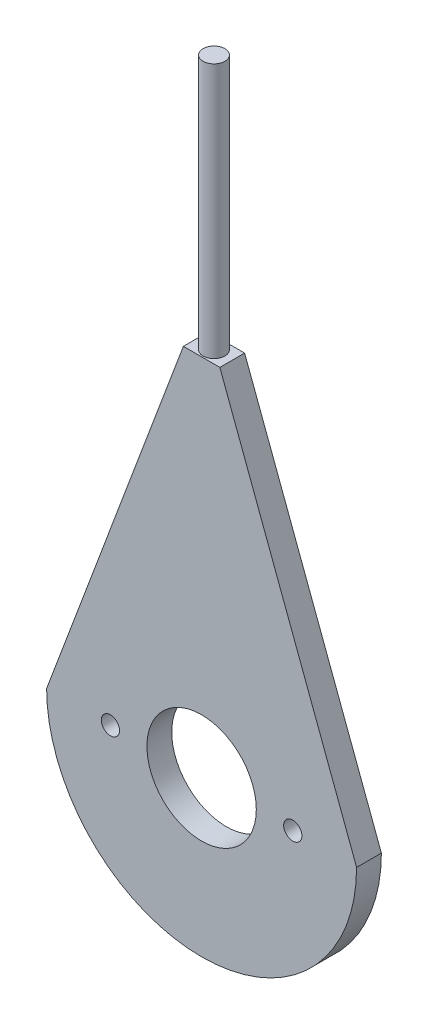
ISO-10303-21;
HEADER;
FILE_DESCRIPTION(('STEP AP214'),'2;1');
FILE_NAME('part.step','',(''),(''),'','','');
FILE_SCHEMA(('AUTOMOTIVE_DESIGN { 1 0 10303 214 1 1 1 1 }'));
ENDSEC;
DATA;
#1=APPLICATION_CONTEXT('core data for automotive mechanical design processes');
#2=APPLICATION_PROTOCOL_DEFINITION('international standard','automotive_design',2000,#1);
#3=PRODUCT_CONTEXT('',#1,'mechanical');
#4=PRODUCT('Part','Part','',(#3));
#5=PRODUCT_RELATED_PRODUCT_CATEGORY('part','',(#4));
#6=PRODUCT_DEFINITION_FORMATION('','',#4);
#7=PRODUCT_DEFINITION_CONTEXT('part definition',#1,'design');
#8=PRODUCT_DEFINITION('design','',#6,#7);
#9=PRODUCT_DEFINITION_SHAPE('','',#8);
#10=(LENGTH_UNIT() NAMED_UNIT(*) SI_UNIT(.MILLI.,.METRE.));
#11=(NAMED_UNIT(*) PLANE_ANGLE_UNIT() SI_UNIT($,.RADIAN.));
#12=(NAMED_UNIT(*) SI_UNIT($,.STERADIAN.) SOLID_ANGLE_UNIT());
#13=UNCERTAINTY_MEASURE_WITH_UNIT(LENGTH_MEASURE(1.E-05),#10,'distance_accuracy_value','');
#14=(GEOMETRIC_REPRESENTATION_CONTEXT(3) GLOBAL_UNCERTAINTY_ASSIGNED_CONTEXT((#13)) GLOBAL_UNIT_ASSIGNED_CONTEXT((#10,
#11,#12)) REPRESENTATION_CONTEXT('',''));
#15=CARTESIAN_POINT('',(0.,0.,0.));
#16=DIRECTION('',(0.,0.,1.));
#17=DIRECTION('',(1.,0.,0.));
#18=AXIS2_PLACEMENT_3D('',#15,#16,#17);
#19=CARTESIAN_POINT('',(0.,0.,-6.8));
#20=DIRECTION('',(0.,0.,1.));
#21=DIRECTION('',(1.,0.,0.));
#22=AXIS2_PLACEMENT_3D('',#19,#20,#21);
#23=CYLINDRICAL_SURFACE('',#22,42.5);
#24=CARTESIAN_POINT('',(0.,0.,0.));
#25=DIRECTION('',(0.,0.,1.));
#26=DIRECTION('',(1.,0.,0.));
#27=AXIS2_PLACEMENT_3D('',#24,#25,#26);
#28=CIRCLE('',#27,42.5);
#29=CARTESIAN_POINT('',(-42.5,0.,0.));
#30=VERTEX_POINT('',#29);
#31=CARTESIAN_POINT('',(42.5,0.,0.));
#32=VERTEX_POINT('',#31);
#33=EDGE_CURVE('E105',#30,#32,#28,.T.);
#34=ORIENTED_EDGE('',*,*,#33,.F.);
#35=DIRECTION('',(0.,0.,1.));
#36=VECTOR('',#35,1.);
#37=CARTESIAN_POINT('',(-42.5,0.,-6.8));
#38=LINE('',#37,#36);
#39=CARTESIAN_POINT('',(-42.5,0.,-6.8));
#40=VERTEX_POINT('',#39);
#41=EDGE_CURVE('E11',#40,#30,#38,.T.);
#42=ORIENTED_EDGE('',*,*,#41,.F.);
#43=CARTESIAN_POINT('',(0.,0.,-6.8));
#44=DIRECTION('',(0.,0.,1.));
#45=DIRECTION('',(1.,0.,0.));
#46=AXIS2_PLACEMENT_3D('',#43,#44,#45);
#47=CIRCLE('',#46,42.5);
#48=CARTESIAN_POINT('',(42.5,0.,-6.8));
#49=VERTEX_POINT('',#48);
#50=EDGE_CURVE('E98',#40,#49,#47,.T.);
#51=ORIENTED_EDGE('',*,*,#50,.T.);
#52=DIRECTION('',(0.,0.,1.));
#53=VECTOR('',#52,1.);
#54=CARTESIAN_POINT('',(42.5,0.,-6.8));
#55=LINE('',#54,#53);
#56=EDGE_CURVE('E43',#49,#32,#55,.T.);
#57=ORIENTED_EDGE('',*,*,#56,.T.);
#58=EDGE_LOOP('',(#34,#42,#51,#57));
#59=FACE_BOUND('',#58,.T.);
#60=ADVANCED_FACE('F40',(#59),#23,.T.);
#61=CARTESIAN_POINT('',(-42.5,0.,-6.8));
#62=DIRECTION('',(-0.936329177569044,0.351123441588392,0.));
#63=DIRECTION('',(-0.351123441588392,-0.936329177569045,0.));
#64=AXIS2_PLACEMENT_3D('',#61,#62,#63);
#65=PLANE('',#64);
#66=DIRECTION('',(-0.351123441588392,-0.936329177569044,0.));
#67=VECTOR('',#66,1.);
#68=CARTESIAN_POINT('',(-42.5,0.,0.));
#69=LINE('',#68,#67);
#70=CARTESIAN_POINT('',(-5.,100.,0.));
#71=VERTEX_POINT('',#70);
#72=EDGE_CURVE('E100',#71,#30,#69,.T.);
#73=ORIENTED_EDGE('',*,*,#72,.F.);
#74=DIRECTION('',(0.,0.,1.));
#75=VECTOR('',#74,1.);
#76=CARTESIAN_POINT('',(-5.,100.,-6.8));
#77=LINE('',#76,#75);
#78=CARTESIAN_POINT('',(-5.,100.,-6.8));
#79=VERTEX_POINT('',#78);
#80=EDGE_CURVE('E49',#79,#71,#77,.T.);
#81=ORIENTED_EDGE('',*,*,#80,.F.);
#82=DIRECTION('',(-0.351123441588392,-0.936329177569044,0.));
#83=VECTOR('',#82,1.);
#84=CARTESIAN_POINT('',(-42.5,0.,-6.8));
#85=LINE('',#84,#83);
#86=EDGE_CURVE('E95',#79,#40,#85,.T.);
#87=ORIENTED_EDGE('',*,*,#86,.T.);
#88=ORIENTED_EDGE('',*,*,#41,.T.);
#89=EDGE_LOOP('',(#73,#81,#87,#88));
#90=FACE_BOUND('',#89,.T.);
#91=ADVANCED_FACE('F116',(#90),#65,.T.);
#92=CARTESIAN_POINT('',(-5.,100.,-6.8));
#93=DIRECTION('',(0.,1.,0.));
#94=DIRECTION('',(0.,0.,1.));
#95=AXIS2_PLACEMENT_3D('',#92,#93,#94);
#96=PLANE('',#95);
#97=CARTESIAN_POINT('',(0.,100.,-3.4));
#98=DIRECTION('',(0.,1.,0.));
#99=DIRECTION('',(0.,0.,1.));
#100=AXIS2_PLACEMENT_3D('',#97,#98,#99);
#101=CIRCLE('',#100,3.);
#102=CARTESIAN_POINT('',(0.,100.,-0.399999999999999));
#103=VERTEX_POINT('',#102);
#104=EDGE_CURVE('E164',#103,#103,#101,.T.);
#105=ORIENTED_EDGE('',*,*,#104,.F.);
#106=EDGE_LOOP('',(#105));
#107=FACE_BOUND('',#106,.T.);
#108=DIRECTION('',(-1.,0.,0.));
#109=VECTOR('',#108,1.);
#110=CARTESIAN_POINT('',(-5.,100.,0.));
#111=LINE('',#110,#109);
#112=CARTESIAN_POINT('',(5.,100.,0.));
#113=VERTEX_POINT('',#112);
#114=EDGE_CURVE('E90',#113,#71,#111,.T.);
#115=ORIENTED_EDGE('',*,*,#114,.F.);
#116=DIRECTION('',(0.,0.,1.));
#117=VECTOR('',#116,1.);
#118=CARTESIAN_POINT('',(5.,100.,-6.8));
#119=LINE('',#118,#117);
#120=CARTESIAN_POINT('',(5.,100.,-6.8));
#121=VERTEX_POINT('',#120);
#122=EDGE_CURVE('E85',#121,#113,#119,.T.);
#123=ORIENTED_EDGE('',*,*,#122,.F.);
#124=DIRECTION('',(-1.,0.,0.));
#125=VECTOR('',#124,1.);
#126=CARTESIAN_POINT('',(-5.,100.,-6.8));
#127=LINE('',#126,#125);
#128=EDGE_CURVE('E88',#121,#79,#127,.T.);
#129=ORIENTED_EDGE('',*,*,#128,.T.);
#130=ORIENTED_EDGE('',*,*,#80,.T.);
#131=EDGE_LOOP('',(#115,#123,#129,#130));
#132=FACE_BOUND('',#131,.T.);
#133=ADVANCED_FACE('F87',(#107,#132),#96,.T.);
#134=CARTESIAN_POINT('',(5.,100.,-6.8));
#135=DIRECTION('',(0.936329177569044,0.351123441588392,0.));
#136=DIRECTION('',(-0.351123441588392,0.936329177569045,0.));
#137=AXIS2_PLACEMENT_3D('',#134,#135,#136);
#138=PLANE('',#137);
#139=DIRECTION('',(-0.351123441588392,0.936329177569044,0.));
#140=VECTOR('',#139,1.);
#141=CARTESIAN_POINT('',(5.,100.,0.));
#142=LINE('',#141,#140);
#143=EDGE_CURVE('E108',#32,#113,#142,.T.);
#144=ORIENTED_EDGE('',*,*,#143,.F.);
#145=ORIENTED_EDGE('',*,*,#56,.F.);
#146=DIRECTION('',(-0.351123441588392,0.936329177569044,0.));
#147=VECTOR('',#146,1.);
#148=CARTESIAN_POINT('',(5.,100.,-6.8));
#149=LINE('',#148,#147);
#150=EDGE_CURVE('E94',#49,#121,#149,.T.);
#151=ORIENTED_EDGE('',*,*,#150,.T.);
#152=ORIENTED_EDGE('',*,*,#122,.T.);
#153=EDGE_LOOP('',(#144,#145,#151,#152));
#154=FACE_BOUND('',#153,.T.);
#155=ADVANCED_FACE('F97',(#154),#138,.T.);
#156=CARTESIAN_POINT('',(0.,0.,-6.8));
#157=DIRECTION('',(0.,0.,1.));
#158=DIRECTION('',(1.,0.,0.));
#159=AXIS2_PLACEMENT_3D('',#156,#157,#158);
#160=PLANE('',#159);
#161=CARTESIAN_POINT('',(-25.,0.,-6.8));
#162=DIRECTION('',(0.,0.,1.));
#163=DIRECTION('',(-1.,0.,0.));
#164=AXIS2_PLACEMENT_3D('',#161,#162,#163);
#165=CIRCLE('',#164,2.49999999999999);
#166=CARTESIAN_POINT('',(-27.5,0.,-6.8));
#167=VERTEX_POINT('',#166);
#168=EDGE_CURVE('E167',#167,#167,#165,.T.);
#169=ORIENTED_EDGE('',*,*,#168,.T.);
#170=EDGE_LOOP('',(#169));
#171=FACE_BOUND('',#170,.T.);
#172=CARTESIAN_POINT('',(25.,0.,-6.8));
#173=DIRECTION('',(0.,0.,1.));
#174=DIRECTION('',(1.,0.,0.));
#175=AXIS2_PLACEMENT_3D('',#172,#173,#174);
#176=CIRCLE('',#175,2.49999999999999);
#177=CARTESIAN_POINT('',(27.5,0.,-6.8));
#178=VERTEX_POINT('',#177);
#179=EDGE_CURVE('E174',#178,#178,#176,.T.);
#180=ORIENTED_EDGE('',*,*,#179,.T.);
#181=EDGE_LOOP('',(#180));
#182=FACE_BOUND('',#181,.T.);
#183=CARTESIAN_POINT('',(0.,0.,-6.8));
#184=DIRECTION('',(0.,0.,1.));
#185=DIRECTION('',(1.,0.,0.));
#186=AXIS2_PLACEMENT_3D('',#183,#184,#185);
#187=CIRCLE('',#186,15.);
#188=CARTESIAN_POINT('',(15.,0.,-6.8));
#189=VERTEX_POINT('',#188);
#190=EDGE_CURVE('E109',#189,#189,#187,.T.);
#191=ORIENTED_EDGE('',*,*,#190,.T.);
#192=EDGE_LOOP('',(#191));
#193=FACE_BOUND('',#192,.T.);
#194=ORIENTED_EDGE('',*,*,#50,.F.);
#195=ORIENTED_EDGE('',*,*,#86,.F.);
#196=ORIENTED_EDGE('',*,*,#128,.F.);
#197=ORIENTED_EDGE('',*,*,#150,.F.);
#198=EDGE_LOOP('',(#194,#195,#196,#197));
#199=FACE_BOUND('',#198,.T.);
#200=ADVANCED_FACE('F93',(#171,#182,#193,#199),#160,.F.);
#201=CARTESIAN_POINT('',(0.,0.,0.));
#202=DIRECTION('',(0.,0.,1.));
#203=DIRECTION('',(1.,0.,0.));
#204=AXIS2_PLACEMENT_3D('',#201,#202,#203);
#205=PLANE('',#204);
#206=CARTESIAN_POINT('',(-25.,0.,0.));
#207=DIRECTION('',(0.,0.,1.));
#208=DIRECTION('',(-1.,0.,0.));
#209=AXIS2_PLACEMENT_3D('',#206,#207,#208);
#210=CIRCLE('',#209,2.49999999999999);
#211=CARTESIAN_POINT('',(-27.5,0.,0.));
#212=VERTEX_POINT('',#211);
#213=EDGE_CURVE('E163',#212,#212,#210,.T.);
#214=ORIENTED_EDGE('',*,*,#213,.F.);
#215=EDGE_LOOP('',(#214));
#216=FACE_BOUND('',#215,.T.);
#217=CARTESIAN_POINT('',(25.,0.,0.));
#218=DIRECTION('',(0.,0.,1.));
#219=DIRECTION('',(1.,0.,0.));
#220=AXIS2_PLACEMENT_3D('',#217,#218,#219);
#221=CIRCLE('',#220,2.49999999999999);
#222=CARTESIAN_POINT('',(27.5,0.,0.));
#223=VERTEX_POINT('',#222);
#224=EDGE_CURVE('E172',#223,#223,#221,.T.);
#225=ORIENTED_EDGE('',*,*,#224,.F.);
#226=EDGE_LOOP('',(#225));
#227=FACE_BOUND('',#226,.T.);
#228=CARTESIAN_POINT('',(0.,0.,0.));
#229=DIRECTION('',(0.,0.,1.));
#230=DIRECTION('',(1.,0.,0.));
#231=AXIS2_PLACEMENT_3D('',#228,#229,#230);
#232=CIRCLE('',#231,15.);
#233=CARTESIAN_POINT('',(15.,0.,0.));
#234=VERTEX_POINT('',#233);
#235=EDGE_CURVE('E177',#234,#234,#232,.T.);
#236=ORIENTED_EDGE('',*,*,#235,.F.);
#237=EDGE_LOOP('',(#236));
#238=FACE_BOUND('',#237,.T.);
#239=ORIENTED_EDGE('',*,*,#33,.T.);
#240=ORIENTED_EDGE('',*,*,#143,.T.);
#241=ORIENTED_EDGE('',*,*,#114,.T.);
#242=ORIENTED_EDGE('',*,*,#72,.T.);
#243=EDGE_LOOP('',(#239,#240,#241,#242));
#244=FACE_BOUND('',#243,.T.);
#245=ADVANCED_FACE('F115',(#216,#227,#238,#244),#205,.T.);
#246=CARTESIAN_POINT('',(0.,0.,-6.8));
#247=DIRECTION('',(0.,0.,1.));
#248=DIRECTION('',(1.,0.,0.));
#249=AXIS2_PLACEMENT_3D('',#246,#247,#248);
#250=CYLINDRICAL_SURFACE('',#249,15.);
#251=ORIENTED_EDGE('',*,*,#190,.F.);
#252=EDGE_LOOP('',(#251));
#253=FACE_BOUND('',#252,.T.);
#254=ORIENTED_EDGE('',*,*,#235,.T.);
#255=EDGE_LOOP('',(#254));
#256=FACE_BOUND('',#255,.T.);
#257=ADVANCED_FACE('F135',(#253,#256),#250,.F.);
#258=CARTESIAN_POINT('',(25.,0.,-6.8));
#259=DIRECTION('',(0.,0.,1.));
#260=DIRECTION('',(1.,0.,0.));
#261=AXIS2_PLACEMENT_3D('',#258,#259,#260);
#262=CYLINDRICAL_SURFACE('',#261,2.49999999999999);
#263=ORIENTED_EDGE('',*,*,#179,.F.);
#264=EDGE_LOOP('',(#263));
#265=FACE_BOUND('',#264,.T.);
#266=ORIENTED_EDGE('',*,*,#224,.T.);
#267=EDGE_LOOP('',(#266));
#268=FACE_BOUND('',#267,.T.);
#269=ADVANCED_FACE('F142',(#265,#268),#262,.F.);
#270=CARTESIAN_POINT('',(-25.,0.,-6.8));
#271=DIRECTION('',(0.,0.,1.));
#272=DIRECTION('',(1.,0.,0.));
#273=AXIS2_PLACEMENT_3D('',#270,#271,#272);
#274=CYLINDRICAL_SURFACE('',#273,2.49999999999999);
#275=ORIENTED_EDGE('',*,*,#168,.F.);
#276=EDGE_LOOP('',(#275));
#277=FACE_BOUND('',#276,.T.);
#278=ORIENTED_EDGE('',*,*,#213,.T.);
#279=EDGE_LOOP('',(#278));
#280=FACE_BOUND('',#279,.T.);
#281=ADVANCED_FACE('F146',(#277,#280),#274,.F.);
#282=CARTESIAN_POINT('',(0.,170.,-3.4));
#283=DIRECTION('',(0.,-1.,0.));
#284=DIRECTION('',(0.,0.,-1.));
#285=AXIS2_PLACEMENT_3D('',#282,#283,#284);
#286=CYLINDRICAL_SURFACE('',#285,3.);
#287=CARTESIAN_POINT('',(0.,170.,-3.4));
#288=DIRECTION('',(0.,1.,0.));
#289=DIRECTION('',(0.,0.,1.));
#290=AXIS2_PLACEMENT_3D('',#287,#288,#289);
#291=CIRCLE('',#290,3.);
#292=CARTESIAN_POINT('',(0.,170.,-0.399999999999999));
#293=VERTEX_POINT('',#292);
#294=EDGE_CURVE('E162',#293,#293,#291,.T.);
#295=ORIENTED_EDGE('',*,*,#294,.F.);
#296=EDGE_LOOP('',(#295));
#297=FACE_BOUND('',#296,.T.);
#298=ORIENTED_EDGE('',*,*,#104,.T.);
#299=EDGE_LOOP('',(#298));
#300=FACE_BOUND('',#299,.T.);
#301=ADVANCED_FACE('F150',(#297,#300),#286,.T.);
#302=CARTESIAN_POINT('',(0.,170.,-3.4));
#303=DIRECTION('',(0.,1.,0.));
#304=DIRECTION('',(0.,0.,1.));
#305=AXIS2_PLACEMENT_3D('',#302,#303,#304);
#306=PLANE('',#305);
#307=ORIENTED_EDGE('',*,*,#294,.T.);
#308=EDGE_LOOP('',(#307));
#309=FACE_BOUND('',#308,.T.);
#310=ADVANCED_FACE('F154',(#309),#306,.T.);
#311=CLOSED_SHELL('',(#60,#91,#133,#155,#200,#245,#257,#269,#281,#301,#310));
#312=MANIFOLD_SOLID_BREP('B2',#311);
#313=ADVANCED_BREP_SHAPE_REPRESENTATION('',(#18,#312),#14);
#314=SHAPE_DEFINITION_REPRESENTATION(#9,#313);
ENDSEC;
END-ISO-10303-21;
